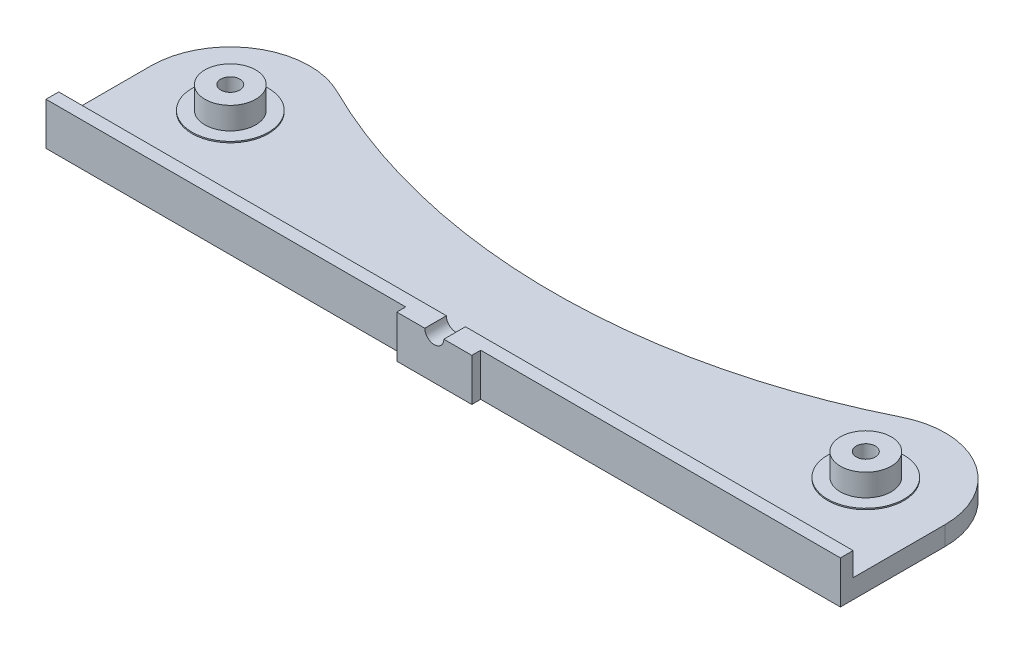
ISO-10303-21;
HEADER;
FILE_DESCRIPTION(('STEP AP214'),'2;1');
FILE_NAME('part.step','',(''),(''),'','','');
FILE_SCHEMA(('AUTOMOTIVE_DESIGN { 1 0 10303 214 1 1 1 1 }'));
ENDSEC;
DATA;
#1=APPLICATION_CONTEXT('core data for automotive mechanical design processes');
#2=APPLICATION_PROTOCOL_DEFINITION('international standard','automotive_design',2000,#1);
#3=PRODUCT_CONTEXT('',#1,'mechanical');
#4=PRODUCT('Part','Part','',(#3));
#5=PRODUCT_RELATED_PRODUCT_CATEGORY('part','',(#4));
#6=PRODUCT_DEFINITION_FORMATION('','',#4);
#7=PRODUCT_DEFINITION_CONTEXT('part definition',#1,'design');
#8=PRODUCT_DEFINITION('design','',#6,#7);
#9=PRODUCT_DEFINITION_SHAPE('','',#8);
#10=(LENGTH_UNIT() NAMED_UNIT(*) SI_UNIT(.MILLI.,.METRE.));
#11=(NAMED_UNIT(*) PLANE_ANGLE_UNIT() SI_UNIT($,.RADIAN.));
#12=(NAMED_UNIT(*) SI_UNIT($,.STERADIAN.) SOLID_ANGLE_UNIT());
#13=UNCERTAINTY_MEASURE_WITH_UNIT(LENGTH_MEASURE(1.E-05),#10,'distance_accuracy_value','');
#14=(GEOMETRIC_REPRESENTATION_CONTEXT(3) GLOBAL_UNCERTAINTY_ASSIGNED_CONTEXT((#13)) GLOBAL_UNIT_ASSIGNED_CONTEXT((#10,
#11,#12)) REPRESENTATION_CONTEXT('',''));
#15=CARTESIAN_POINT('',(0.,0.,0.));
#16=DIRECTION('',(0.,0.,1.));
#17=DIRECTION('',(1.,0.,0.));
#18=AXIS2_PLACEMENT_3D('',#15,#16,#17);
#19=CARTESIAN_POINT('',(0.,6.7,0.));
#20=DIRECTION('',(0.,1.,0.));
#21=DIRECTION('',(0.,0.,1.));
#22=AXIS2_PLACEMENT_3D('',#19,#20,#21);
#23=PLANE('',#22);
#24=DIRECTION('',(0.,0.,-1.));
#25=VECTOR('',#24,1.);
#26=CARTESIAN_POINT('',(1.5,6.7,1.4));
#27=LINE('',#26,#25);
#28=CARTESIAN_POINT('',(1.5,6.7,1.4));
#29=VERTEX_POINT('',#28);
#30=CARTESIAN_POINT('',(1.5,6.7,-2.));
#31=VERTEX_POINT('',#30);
#32=EDGE_CURVE('E95',#29,#31,#27,.T.);
#33=ORIENTED_EDGE('',*,*,#32,.F.);
#34=DIRECTION('',(-1.,0.,0.));
#35=VECTOR('',#34,1.);
#36=CARTESIAN_POINT('',(0.,6.7,1.4));
#37=LINE('',#36,#35);
#38=CARTESIAN_POINT('',(5.9,6.7,1.4));
#39=VERTEX_POINT('',#38);
#40=EDGE_CURVE('E193',#39,#29,#37,.T.);
#41=ORIENTED_EDGE('',*,*,#40,.F.);
#42=DIRECTION('',(0.,0.,-1.));
#43=VECTOR('',#42,1.);
#44=CARTESIAN_POINT('',(5.9,6.7,0.));
#45=LINE('',#44,#43);
#46=CARTESIAN_POINT('',(5.9,6.7,0.));
#47=VERTEX_POINT('',#46);
#48=EDGE_CURVE('E202',#39,#47,#45,.T.);
#49=ORIENTED_EDGE('',*,*,#48,.T.);
#50=DIRECTION('',(-1.,0.,0.));
#51=VECTOR('',#50,1.);
#52=CARTESIAN_POINT('',(0.,6.7,0.));
#53=LINE('',#52,#51);
#54=CARTESIAN_POINT('',(62.5,6.7,0.));
#55=VERTEX_POINT('',#54);
#56=EDGE_CURVE('E206',#55,#47,#53,.T.);
#57=ORIENTED_EDGE('',*,*,#56,.F.);
#58=DIRECTION('',(0.,0.,1.));
#59=VECTOR('',#58,1.);
#60=CARTESIAN_POINT('',(62.5,6.7,0.));
#61=LINE('',#60,#59);
#62=CARTESIAN_POINT('',(62.5,6.7,-2.));
#63=VERTEX_POINT('',#62);
#64=EDGE_CURVE('E305',#63,#55,#61,.T.);
#65=ORIENTED_EDGE('',*,*,#64,.F.);
#66=DIRECTION('',(-1.,0.,0.));
#67=VECTOR('',#66,1.);
#68=CARTESIAN_POINT('',(0.,6.7,-2.));
#69=LINE('',#68,#67);
#70=EDGE_CURVE('E312',#63,#31,#69,.T.);
#71=ORIENTED_EDGE('',*,*,#70,.T.);
#72=EDGE_LOOP('',(#33,#41,#49,#57,#65,#71));
#73=FACE_BOUND('',#72,.T.);
#74=ADVANCED_FACE('F78',(#73),#23,.T.);
#75=CARTESIAN_POINT('',(0.,3.,0.));
#76=DIRECTION('',(0.,1.,0.));
#77=DIRECTION('',(0.,0.,1.));
#78=AXIS2_PLACEMENT_3D('',#75,#76,#77);
#79=PLANE('',#78);
#80=CARTESIAN_POINT('',(50.,3.,-16.5));
#81=DIRECTION('',(0.,1.,0.));
#82=DIRECTION('',(0.,0.,1.));
#83=AXIS2_PLACEMENT_3D('',#80,#81,#82);
#84=CIRCLE('',#83,6.);
#85=CARTESIAN_POINT('',(50.,3.,-10.5));
#86=VERTEX_POINT('',#85);
#87=EDGE_CURVE('E301',#86,#86,#84,.T.);
#88=ORIENTED_EDGE('',*,*,#87,.F.);
#89=EDGE_LOOP('',(#88));
#90=FACE_BOUND('',#89,.T.);
#91=CARTESIAN_POINT('',(-50.,3.,-16.5));
#92=DIRECTION('',(0.,1.,0.));
#93=DIRECTION('',(0.,0.,1.));
#94=AXIS2_PLACEMENT_3D('',#91,#92,#93);
#95=CIRCLE('',#94,6.);
#96=CARTESIAN_POINT('',(-50.,3.,-10.5));
#97=VERTEX_POINT('',#96);
#98=EDGE_CURVE('E294',#97,#97,#95,.T.);
#99=ORIENTED_EDGE('',*,*,#98,.F.);
#100=EDGE_LOOP('',(#99));
#101=FACE_BOUND('',#100,.T.);
#102=DIRECTION('',(0.,0.,-1.));
#103=VECTOR('',#102,1.);
#104=CARTESIAN_POINT('',(-62.5,3.,0.));
#105=LINE('',#104,#103);
#106=CARTESIAN_POINT('',(-62.5,3.,-2.));
#107=VERTEX_POINT('',#106);
#108=CARTESIAN_POINT('',(-62.5,3.,-16.5));
#109=VERTEX_POINT('',#108);
#110=EDGE_CURVE('E237',#107,#109,#105,.T.);
#111=ORIENTED_EDGE('',*,*,#110,.F.);
#112=DIRECTION('',(-1.,0.,0.));
#113=VECTOR('',#112,1.);
#114=CARTESIAN_POINT('',(0.,3.,-2.));
#115=LINE('',#114,#113);
#116=CARTESIAN_POINT('',(62.5,3.,-2.));
#117=VERTEX_POINT('',#116);
#118=EDGE_CURVE('E216',#117,#107,#115,.T.);
#119=ORIENTED_EDGE('',*,*,#118,.F.);
#120=DIRECTION('',(0.,0.,-1.));
#121=VECTOR('',#120,1.);
#122=CARTESIAN_POINT('',(62.5,3.,0.));
#123=LINE('',#122,#121);
#124=CARTESIAN_POINT('',(62.5,3.,-16.5));
#125=VERTEX_POINT('',#124);
#126=EDGE_CURVE('E226',#117,#125,#123,.T.);
#127=ORIENTED_EDGE('',*,*,#126,.T.);
#128=CARTESIAN_POINT('',(50.,3.,-16.5));
#129=DIRECTION('',(0.,1.,0.));
#130=DIRECTION('',(0.,0.,1.));
#131=AXIS2_PLACEMENT_3D('',#128,#129,#130);
#132=CIRCLE('',#131,12.5);
#133=CARTESIAN_POINT('',(44.4444444444444,3.,-27.6975802059702));
#134=VERTEX_POINT('',#133);
#135=EDGE_CURVE('E228',#125,#134,#132,.T.);
#136=ORIENTED_EDGE('',*,*,#135,.T.);
#137=CARTESIAN_POINT('',(0.,3.,-117.278221853732));
#138=DIRECTION('',(0.,1.,0.));
#139=DIRECTION('',(0.,0.,1.));
#140=AXIS2_PLACEMENT_3D('',#137,#138,#139);
#141=CIRCLE('',#140,100.);
#142=CARTESIAN_POINT('',(-44.4444444444444,3.,-27.6975802059702));
#143=VERTEX_POINT('',#142);
#144=EDGE_CURVE('E231',#143,#134,#141,.T.);
#145=ORIENTED_EDGE('',*,*,#144,.F.);
#146=CARTESIAN_POINT('',(-50.,3.,-16.5));
#147=DIRECTION('',(0.,1.,0.));
#148=DIRECTION('',(0.,0.,1.));
#149=AXIS2_PLACEMENT_3D('',#146,#147,#148);
#150=CIRCLE('',#149,12.5);
#151=EDGE_CURVE('E234',#143,#109,#150,.T.);
#152=ORIENTED_EDGE('',*,*,#151,.T.);
#153=EDGE_LOOP('',(#111,#119,#127,#136,#145,#152));
#154=FACE_BOUND('',#153,.T.);
#155=ADVANCED_FACE('F369',(#90,#101,#154),#79,.T.);
#156=CARTESIAN_POINT('',(0.,0.,0.));
#157=DIRECTION('',(0.,1.,0.));
#158=DIRECTION('',(0.,0.,1.));
#159=AXIS2_PLACEMENT_3D('',#156,#157,#158);
#160=PLANE('',#159);
#161=DIRECTION('',(0.,0.,-1.));
#162=VECTOR('',#161,1.);
#163=CARTESIAN_POINT('',(-62.5,0.,0.));
#164=LINE('',#163,#162);
#165=CARTESIAN_POINT('',(-62.5,0.,0.));
#166=VERTEX_POINT('',#165);
#167=CARTESIAN_POINT('',(-62.5,0.,-16.5));
#168=VERTEX_POINT('',#167);
#169=EDGE_CURVE('E252',#166,#168,#164,.T.);
#170=ORIENTED_EDGE('',*,*,#169,.T.);
#171=CARTESIAN_POINT('',(-50.,0.,-16.5));
#172=DIRECTION('',(0.,1.,0.));
#173=DIRECTION('',(0.,0.,1.));
#174=AXIS2_PLACEMENT_3D('',#171,#172,#173);
#175=CIRCLE('',#174,12.5);
#176=CARTESIAN_POINT('',(-44.4444444444444,0.,-27.6975802059702));
#177=VERTEX_POINT('',#176);
#178=EDGE_CURVE('E249',#177,#168,#175,.T.);
#179=ORIENTED_EDGE('',*,*,#178,.F.);
#180=CARTESIAN_POINT('',(0.,0.,-117.278221853732));
#181=DIRECTION('',(0.,1.,0.));
#182=DIRECTION('',(0.,0.,1.));
#183=AXIS2_PLACEMENT_3D('',#180,#181,#182);
#184=CIRCLE('',#183,100.);
#185=CARTESIAN_POINT('',(44.4444444444444,0.,-27.6975802059702));
#186=VERTEX_POINT('',#185);
#187=EDGE_CURVE('E246',#177,#186,#184,.T.);
#188=ORIENTED_EDGE('',*,*,#187,.T.);
#189=CARTESIAN_POINT('',(50.,0.,-16.5));
#190=DIRECTION('',(0.,1.,0.));
#191=DIRECTION('',(0.,0.,1.));
#192=AXIS2_PLACEMENT_3D('',#189,#190,#191);
#193=CIRCLE('',#192,12.5);
#194=CARTESIAN_POINT('',(62.5,0.,-16.5));
#195=VERTEX_POINT('',#194);
#196=EDGE_CURVE('E242',#195,#186,#193,.T.);
#197=ORIENTED_EDGE('',*,*,#196,.F.);
#198=DIRECTION('',(0.,0.,-1.));
#199=VECTOR('',#198,1.);
#200=CARTESIAN_POINT('',(62.5,0.,0.));
#201=LINE('',#200,#199);
#202=CARTESIAN_POINT('',(62.5,0.,0.));
#203=VERTEX_POINT('',#202);
#204=EDGE_CURVE('E240',#203,#195,#201,.T.);
#205=ORIENTED_EDGE('',*,*,#204,.F.);
#206=DIRECTION('',(1.,0.,0.));
#207=VECTOR('',#206,1.);
#208=CARTESIAN_POINT('',(0.,0.,0.));
#209=LINE('',#208,#207);
#210=CARTESIAN_POINT('',(5.9,0.,0.));
#211=VERTEX_POINT('',#210);
#212=EDGE_CURVE('E254',#211,#203,#209,.T.);
#213=ORIENTED_EDGE('',*,*,#212,.F.);
#214=DIRECTION('',(0.,0.,1.));
#215=VECTOR('',#214,1.);
#216=CARTESIAN_POINT('',(5.9,0.,0.));
#217=LINE('',#216,#215);
#218=CARTESIAN_POINT('',(5.9,0.,1.4));
#219=VERTEX_POINT('',#218);
#220=EDGE_CURVE('E280',#211,#219,#217,.T.);
#221=ORIENTED_EDGE('',*,*,#220,.T.);
#222=DIRECTION('',(1.,0.,0.));
#223=VECTOR('',#222,1.);
#224=CARTESIAN_POINT('',(-5.9,0.,1.4));
#225=LINE('',#224,#223);
#226=CARTESIAN_POINT('',(-5.9,0.,1.4));
#227=VERTEX_POINT('',#226);
#228=EDGE_CURVE('E225',#227,#219,#225,.T.);
#229=ORIENTED_EDGE('',*,*,#228,.F.);
#230=DIRECTION('',(0.,0.,1.));
#231=VECTOR('',#230,1.);
#232=CARTESIAN_POINT('',(-5.9,0.,0.));
#233=LINE('',#232,#231);
#234=CARTESIAN_POINT('',(-5.9,0.,0.));
#235=VERTEX_POINT('',#234);
#236=EDGE_CURVE('E283',#235,#227,#233,.T.);
#237=ORIENTED_EDGE('',*,*,#236,.F.);
#238=EDGE_CURVE('E255',#166,#235,#209,.T.);
#239=ORIENTED_EDGE('',*,*,#238,.F.);
#240=EDGE_LOOP('',(#170,#179,#188,#197,#205,#213,#221,#229,#237,#239));
#241=FACE_BOUND('',#240,.T.);
#242=CARTESIAN_POINT('',(-50.,0.,-16.5));
#243=DIRECTION('',(0.,1.,0.));
#244=DIRECTION('',(0.,0.,1.));
#245=AXIS2_PLACEMENT_3D('',#242,#243,#244);
#246=CIRCLE('',#245,1.5);
#247=CARTESIAN_POINT('',(-50.,0.,-15.));
#248=VERTEX_POINT('',#247);
#249=EDGE_CURVE('E229',#248,#248,#246,.T.);
#250=ORIENTED_EDGE('',*,*,#249,.T.);
#251=EDGE_LOOP('',(#250));
#252=FACE_BOUND('',#251,.T.);
#253=CARTESIAN_POINT('',(50.,0.,-16.5));
#254=DIRECTION('',(0.,1.,0.));
#255=DIRECTION('',(0.,0.,1.));
#256=AXIS2_PLACEMENT_3D('',#253,#254,#255);
#257=CIRCLE('',#256,1.5);
#258=CARTESIAN_POINT('',(50.,0.,-15.));
#259=VERTEX_POINT('',#258);
#260=EDGE_CURVE('E258',#259,#259,#257,.T.);
#261=ORIENTED_EDGE('',*,*,#260,.T.);
#262=EDGE_LOOP('',(#261));
#263=FACE_BOUND('',#262,.T.);
#264=ADVANCED_FACE('F328',(#241,#252,#263),#160,.F.);
#265=CARTESIAN_POINT('',(0.,3.,0.));
#266=DIRECTION('',(0.,0.,-1.));
#267=DIRECTION('',(-1.,0.,0.));
#268=AXIS2_PLACEMENT_3D('',#265,#266,#267);
#269=PLANE('',#268);
#270=DIRECTION('',(0.,-1.,0.));
#271=VECTOR('',#270,1.);
#272=CARTESIAN_POINT('',(-5.9,3.,0.));
#273=LINE('',#272,#271);
#274=CARTESIAN_POINT('',(-5.9,6.7,0.));
#275=VERTEX_POINT('',#274);
#276=EDGE_CURVE('E277',#275,#235,#273,.T.);
#277=ORIENTED_EDGE('',*,*,#276,.F.);
#278=CARTESIAN_POINT('',(-62.5,6.7,0.));
#279=VERTEX_POINT('',#278);
#280=EDGE_CURVE('E308',#275,#279,#53,.T.);
#281=ORIENTED_EDGE('',*,*,#280,.T.);
#282=DIRECTION('',(0.,-1.,0.));
#283=VECTOR('',#282,1.);
#284=CARTESIAN_POINT('',(-62.5,3.,0.));
#285=LINE('',#284,#283);
#286=EDGE_CURVE('E265',#279,#166,#285,.T.);
#287=ORIENTED_EDGE('',*,*,#286,.T.);
#288=ORIENTED_EDGE('',*,*,#238,.T.);
#289=EDGE_LOOP('',(#277,#281,#287,#288));
#290=FACE_BOUND('',#289,.T.);
#291=ADVANCED_FACE('F321',(#290),#269,.F.);
#292=DIRECTION('',(0.,-1.,0.));
#293=VECTOR('',#292,1.);
#294=CARTESIAN_POINT('',(62.5,3.,0.));
#295=LINE('',#294,#293);
#296=EDGE_CURVE('E239',#55,#203,#295,.T.);
#297=ORIENTED_EDGE('',*,*,#296,.F.);
#298=ORIENTED_EDGE('',*,*,#56,.T.);
#299=DIRECTION('',(0.,-1.,0.));
#300=VECTOR('',#299,1.);
#301=CARTESIAN_POINT('',(5.9,3.,0.));
#302=LINE('',#301,#300);
#303=EDGE_CURVE('E87',#47,#211,#302,.T.);
#304=ORIENTED_EDGE('',*,*,#303,.T.);
#305=ORIENTED_EDGE('',*,*,#212,.T.);
#306=EDGE_LOOP('',(#297,#298,#304,#305));
#307=FACE_BOUND('',#306,.T.);
#308=ADVANCED_FACE('F362',(#307),#269,.F.);
#309=CARTESIAN_POINT('',(5.9,3.,0.));
#310=DIRECTION('',(1.,0.,0.));
#311=DIRECTION('',(0.,0.,-1.));
#312=AXIS2_PLACEMENT_3D('',#309,#310,#311);
#313=PLANE('',#312);
#314=ORIENTED_EDGE('',*,*,#220,.F.);
#315=ORIENTED_EDGE('',*,*,#303,.F.);
#316=ORIENTED_EDGE('',*,*,#48,.F.);
#317=DIRECTION('',(0.,-1.,0.));
#318=VECTOR('',#317,1.);
#319=CARTESIAN_POINT('',(5.9,3.,1.4));
#320=LINE('',#319,#318);
#321=EDGE_CURVE('E243',#39,#219,#320,.T.);
#322=ORIENTED_EDGE('',*,*,#321,.T.);
#323=EDGE_LOOP('',(#314,#315,#316,#322));
#324=FACE_BOUND('',#323,.T.);
#325=ADVANCED_FACE('F334',(#324),#313,.T.);
#326=CARTESIAN_POINT('',(-5.9,3.,0.));
#327=DIRECTION('',(1.,0.,0.));
#328=DIRECTION('',(0.,0.,-1.));
#329=AXIS2_PLACEMENT_3D('',#326,#327,#328);
#330=PLANE('',#329);
#331=ORIENTED_EDGE('',*,*,#236,.T.);
#332=DIRECTION('',(0.,-1.,0.));
#333=VECTOR('',#332,1.);
#334=CARTESIAN_POINT('',(-5.9,3.,1.4));
#335=LINE('',#334,#333);
#336=CARTESIAN_POINT('',(-5.9,6.7,1.4));
#337=VERTEX_POINT('',#336);
#338=EDGE_CURVE('E285',#337,#227,#335,.T.);
#339=ORIENTED_EDGE('',*,*,#338,.F.);
#340=DIRECTION('',(0.,0.,-1.));
#341=VECTOR('',#340,1.);
#342=CARTESIAN_POINT('',(-5.9,6.7,0.));
#343=LINE('',#342,#341);
#344=EDGE_CURVE('E200',#337,#275,#343,.T.);
#345=ORIENTED_EDGE('',*,*,#344,.T.);
#346=ORIENTED_EDGE('',*,*,#276,.T.);
#347=EDGE_LOOP('',(#331,#339,#345,#346));
#348=FACE_BOUND('',#347,.T.);
#349=ADVANCED_FACE('F324',(#348),#330,.F.);
#350=CARTESIAN_POINT('',(-5.9,3.,1.4));
#351=DIRECTION('',(0.,0.,-1.));
#352=DIRECTION('',(-1.,0.,0.));
#353=AXIS2_PLACEMENT_3D('',#350,#351,#352);
#354=PLANE('',#353);
#355=ORIENTED_EDGE('',*,*,#40,.T.);
#356=CARTESIAN_POINT('',(0.,6.7,1.4));
#357=DIRECTION('',(0.,0.,-1.));
#358=DIRECTION('',(-1.,0.,0.));
#359=AXIS2_PLACEMENT_3D('',#356,#357,#358);
#360=CIRCLE('',#359,1.5);
#361=CARTESIAN_POINT('',(-1.5,6.7,1.4));
#362=VERTEX_POINT('',#361);
#363=EDGE_CURVE('E182',#29,#362,#360,.T.);
#364=ORIENTED_EDGE('',*,*,#363,.T.);
#365=EDGE_CURVE('E190',#362,#337,#37,.T.);
#366=ORIENTED_EDGE('',*,*,#365,.T.);
#367=ORIENTED_EDGE('',*,*,#338,.T.);
#368=ORIENTED_EDGE('',*,*,#228,.T.);
#369=ORIENTED_EDGE('',*,*,#321,.F.);
#370=EDGE_LOOP('',(#355,#364,#366,#367,#368,#369));
#371=FACE_BOUND('',#370,.T.);
#372=ADVANCED_FACE('F80',(#371),#354,.F.);
#373=CARTESIAN_POINT('',(62.5,3.,0.));
#374=DIRECTION('',(-1.,0.,0.));
#375=DIRECTION('',(0.,0.,1.));
#376=AXIS2_PLACEMENT_3D('',#373,#374,#375);
#377=PLANE('',#376);
#378=DIRECTION('',(0.,-1.,0.));
#379=VECTOR('',#378,1.);
#380=CARTESIAN_POINT('',(62.5,3.,-16.5));
#381=LINE('',#380,#379);
#382=EDGE_CURVE('E274',#125,#195,#381,.T.);
#383=ORIENTED_EDGE('',*,*,#382,.F.);
#384=ORIENTED_EDGE('',*,*,#126,.F.);
#385=DIRECTION('',(0.,-1.,0.));
#386=VECTOR('',#385,1.);
#387=CARTESIAN_POINT('',(62.5,6.7,-2.));
#388=LINE('',#387,#386);
#389=EDGE_CURVE('E211',#63,#117,#388,.T.);
#390=ORIENTED_EDGE('',*,*,#389,.F.);
#391=ORIENTED_EDGE('',*,*,#64,.T.);
#392=ORIENTED_EDGE('',*,*,#296,.T.);
#393=ORIENTED_EDGE('',*,*,#204,.T.);
#394=EDGE_LOOP('',(#383,#384,#390,#391,#392,#393));
#395=FACE_BOUND('',#394,.T.);
#396=ADVANCED_FACE('F360',(#395),#377,.F.);
#397=CARTESIAN_POINT('',(50.,3.,-16.5));
#398=DIRECTION('',(0.,-1.,0.));
#399=DIRECTION('',(0.,0.,-1.));
#400=AXIS2_PLACEMENT_3D('',#397,#398,#399);
#401=CYLINDRICAL_SURFACE('',#400,12.5);
#402=ORIENTED_EDGE('',*,*,#196,.T.);
#403=DIRECTION('',(0.,-1.,0.));
#404=VECTOR('',#403,1.);
#405=CARTESIAN_POINT('',(44.4444444444444,3.,-27.6975802059702));
#406=LINE('',#405,#404);
#407=EDGE_CURVE('E272',#134,#186,#406,.T.);
#408=ORIENTED_EDGE('',*,*,#407,.F.);
#409=ORIENTED_EDGE('',*,*,#135,.F.);
#410=ORIENTED_EDGE('',*,*,#382,.T.);
#411=EDGE_LOOP('',(#402,#408,#409,#410));
#412=FACE_BOUND('',#411,.T.);
#413=ADVANCED_FACE('F357',(#412),#401,.T.);
#414=CARTESIAN_POINT('',(0.,3.,-117.278221853732));
#415=DIRECTION('',(0.,-1.,0.));
#416=DIRECTION('',(0.,0.,-1.));
#417=AXIS2_PLACEMENT_3D('',#414,#415,#416);
#418=CYLINDRICAL_SURFACE('',#417,100.);
#419=ORIENTED_EDGE('',*,*,#187,.F.);
#420=DIRECTION('',(0.,-1.,0.));
#421=VECTOR('',#420,1.);
#422=CARTESIAN_POINT('',(-44.4444444444444,3.,-27.6975802059702));
#423=LINE('',#422,#421);
#424=EDGE_CURVE('E270',#143,#177,#423,.T.);
#425=ORIENTED_EDGE('',*,*,#424,.F.);
#426=ORIENTED_EDGE('',*,*,#144,.T.);
#427=ORIENTED_EDGE('',*,*,#407,.T.);
#428=EDGE_LOOP('',(#419,#425,#426,#427));
#429=FACE_BOUND('',#428,.T.);
#430=ADVANCED_FACE('F351',(#429),#418,.F.);
#431=CARTESIAN_POINT('',(-50.,3.,-16.5));
#432=DIRECTION('',(0.,-1.,0.));
#433=DIRECTION('',(0.,0.,-1.));
#434=AXIS2_PLACEMENT_3D('',#431,#432,#433);
#435=CYLINDRICAL_SURFACE('',#434,12.5);
#436=ORIENTED_EDGE('',*,*,#178,.T.);
#437=DIRECTION('',(0.,-1.,0.));
#438=VECTOR('',#437,1.);
#439=CARTESIAN_POINT('',(-62.5,3.,-16.5));
#440=LINE('',#439,#438);
#441=EDGE_CURVE('E267',#109,#168,#440,.T.);
#442=ORIENTED_EDGE('',*,*,#441,.F.);
#443=ORIENTED_EDGE('',*,*,#151,.F.);
#444=ORIENTED_EDGE('',*,*,#424,.T.);
#445=EDGE_LOOP('',(#436,#442,#443,#444));
#446=FACE_BOUND('',#445,.T.);
#447=ADVANCED_FACE('F425',(#446),#435,.T.);
#448=CARTESIAN_POINT('',(-62.5,3.,0.));
#449=DIRECTION('',(-1.,0.,0.));
#450=DIRECTION('',(0.,0.,1.));
#451=AXIS2_PLACEMENT_3D('',#448,#449,#450);
#452=PLANE('',#451);
#453=ORIENTED_EDGE('',*,*,#441,.T.);
#454=ORIENTED_EDGE('',*,*,#169,.F.);
#455=ORIENTED_EDGE('',*,*,#286,.F.);
#456=DIRECTION('',(0.,0.,1.));
#457=VECTOR('',#456,1.);
#458=CARTESIAN_POINT('',(-62.5,6.7,0.));
#459=LINE('',#458,#457);
#460=CARTESIAN_POINT('',(-62.5,6.7,-2.));
#461=VERTEX_POINT('',#460);
#462=EDGE_CURVE('E314',#461,#279,#459,.T.);
#463=ORIENTED_EDGE('',*,*,#462,.F.);
#464=DIRECTION('',(0.,-1.,0.));
#465=VECTOR('',#464,1.);
#466=CARTESIAN_POINT('',(-62.5,6.7,-2.));
#467=LINE('',#466,#465);
#468=EDGE_CURVE('E102',#461,#107,#467,.T.);
#469=ORIENTED_EDGE('',*,*,#468,.T.);
#470=ORIENTED_EDGE('',*,*,#110,.T.);
#471=EDGE_LOOP('',(#453,#454,#455,#463,#469,#470));
#472=FACE_BOUND('',#471,.T.);
#473=ADVANCED_FACE('F343',(#472),#452,.T.);
#474=CARTESIAN_POINT('',(50.,3.,-16.5));
#475=DIRECTION('',(0.,-1.,0.));
#476=DIRECTION('',(0.,0.,-1.));
#477=AXIS2_PLACEMENT_3D('',#474,#475,#476);
#478=CYLINDRICAL_SURFACE('',#477,1.5);
#479=CARTESIAN_POINT('',(50.,6.7,-16.5));
#480=DIRECTION('',(0.,1.,0.));
#481=DIRECTION('',(0.,0.,1.));
#482=AXIS2_PLACEMENT_3D('',#479,#480,#481);
#483=CIRCLE('',#482,1.5);
#484=CARTESIAN_POINT('',(50.,6.7,-15.));
#485=VERTEX_POINT('',#484);
#486=EDGE_CURVE('E215',#485,#485,#483,.T.);
#487=ORIENTED_EDGE('',*,*,#486,.T.);
#488=EDGE_LOOP('',(#487));
#489=FACE_BOUND('',#488,.T.);
#490=ORIENTED_EDGE('',*,*,#260,.F.);
#491=EDGE_LOOP('',(#490));
#492=FACE_BOUND('',#491,.T.);
#493=ADVANCED_FACE('F432',(#489,#492),#478,.F.);
#494=CARTESIAN_POINT('',(-50.,3.,-16.5));
#495=DIRECTION('',(0.,-1.,0.));
#496=DIRECTION('',(0.,0.,-1.));
#497=AXIS2_PLACEMENT_3D('',#494,#495,#496);
#498=CYLINDRICAL_SURFACE('',#497,1.5);
#499=CARTESIAN_POINT('',(-50.,6.7,-16.5));
#500=DIRECTION('',(0.,1.,0.));
#501=DIRECTION('',(0.,0.,1.));
#502=AXIS2_PLACEMENT_3D('',#499,#500,#501);
#503=CIRCLE('',#502,1.5);
#504=CARTESIAN_POINT('',(-50.,6.7,-15.));
#505=VERTEX_POINT('',#504);
#506=EDGE_CURVE('E219',#505,#505,#503,.T.);
#507=ORIENTED_EDGE('',*,*,#506,.T.);
#508=EDGE_LOOP('',(#507));
#509=FACE_BOUND('',#508,.T.);
#510=ORIENTED_EDGE('',*,*,#249,.F.);
#511=EDGE_LOOP('',(#510));
#512=FACE_BOUND('',#511,.T.);
#513=ADVANCED_FACE('F523',(#509,#512),#498,.F.);
#514=CARTESIAN_POINT('',(-50.,6.7,-16.5));
#515=DIRECTION('',(0.,1.,0.));
#516=DIRECTION('',(0.,0.,1.));
#517=AXIS2_PLACEMENT_3D('',#514,#515,#516);
#518=PLANE('',#517);
#519=CARTESIAN_POINT('',(-50.,6.7,-16.5));
#520=DIRECTION('',(0.,1.,0.));
#521=DIRECTION('',(0.,0.,1.));
#522=AXIS2_PLACEMENT_3D('',#519,#520,#521);
#523=CIRCLE('',#522,4.00000000000001);
#524=CARTESIAN_POINT('',(-50.,6.7,-12.5));
#525=VERTEX_POINT('',#524);
#526=EDGE_CURVE('E222',#525,#525,#523,.T.);
#527=ORIENTED_EDGE('',*,*,#526,.T.);
#528=EDGE_LOOP('',(#527));
#529=FACE_BOUND('',#528,.T.);
#530=ORIENTED_EDGE('',*,*,#506,.F.);
#531=EDGE_LOOP('',(#530));
#532=FACE_BOUND('',#531,.T.);
#533=ADVANCED_FACE('F535',(#529,#532),#518,.T.);
#534=CARTESIAN_POINT('',(-50.,6.7,-16.5));
#535=DIRECTION('',(0.,-1.,0.));
#536=DIRECTION('',(0.,0.,-1.));
#537=AXIS2_PLACEMENT_3D('',#534,#535,#536);
#538=CYLINDRICAL_SURFACE('',#537,4.00000000000001);
#539=CARTESIAN_POINT('',(-50.,3.2,-16.5));
#540=DIRECTION('',(0.,1.,0.));
#541=DIRECTION('',(0.,0.,1.));
#542=AXIS2_PLACEMENT_3D('',#539,#540,#541);
#543=CIRCLE('',#542,4.00000000000001);
#544=CARTESIAN_POINT('',(-50.,3.2,-12.5));
#545=VERTEX_POINT('',#544);
#546=EDGE_CURVE('E194',#545,#545,#543,.T.);
#547=ORIENTED_EDGE('',*,*,#546,.T.);
#548=EDGE_LOOP('',(#547));
#549=FACE_BOUND('',#548,.T.);
#550=ORIENTED_EDGE('',*,*,#526,.F.);
#551=EDGE_LOOP('',(#550));
#552=FACE_BOUND('',#551,.T.);
#553=ADVANCED_FACE('F547',(#549,#552),#538,.T.);
#554=CARTESIAN_POINT('',(50.,6.7,-16.5));
#555=DIRECTION('',(0.,1.,0.));
#556=DIRECTION('',(0.,0.,1.));
#557=AXIS2_PLACEMENT_3D('',#554,#555,#556);
#558=PLANE('',#557);
#559=CARTESIAN_POINT('',(50.,6.7,-16.5));
#560=DIRECTION('',(0.,1.,0.));
#561=DIRECTION('',(0.,0.,1.));
#562=AXIS2_PLACEMENT_3D('',#559,#560,#561);
#563=CIRCLE('',#562,4.00000000000001);
#564=CARTESIAN_POINT('',(50.,6.7,-12.5));
#565=VERTEX_POINT('',#564);
#566=EDGE_CURVE('E212',#565,#565,#563,.T.);
#567=ORIENTED_EDGE('',*,*,#566,.T.);
#568=EDGE_LOOP('',(#567));
#569=FACE_BOUND('',#568,.T.);
#570=ORIENTED_EDGE('',*,*,#486,.F.);
#571=EDGE_LOOP('',(#570));
#572=FACE_BOUND('',#571,.T.);
#573=ADVANCED_FACE('F389',(#569,#572),#558,.T.);
#574=CARTESIAN_POINT('',(50.,6.7,-16.5));
#575=DIRECTION('',(0.,-1.,0.));
#576=DIRECTION('',(0.,0.,-1.));
#577=AXIS2_PLACEMENT_3D('',#574,#575,#576);
#578=CYLINDRICAL_SURFACE('',#577,4.00000000000001);
#579=CARTESIAN_POINT('',(50.,3.2,-16.5));
#580=DIRECTION('',(0.,1.,0.));
#581=DIRECTION('',(0.,0.,1.));
#582=AXIS2_PLACEMENT_3D('',#579,#580,#581);
#583=CIRCLE('',#582,4.00000000000001);
#584=CARTESIAN_POINT('',(50.,3.2,-12.5));
#585=VERTEX_POINT('',#584);
#586=EDGE_CURVE('E82',#585,#585,#583,.T.);
#587=ORIENTED_EDGE('',*,*,#586,.T.);
#588=EDGE_LOOP('',(#587));
#589=FACE_BOUND('',#588,.T.);
#590=ORIENTED_EDGE('',*,*,#566,.F.);
#591=EDGE_LOOP('',(#590));
#592=FACE_BOUND('',#591,.T.);
#593=ADVANCED_FACE('F384',(#589,#592),#578,.T.);
#594=DIRECTION('',(0.,0.,-1.));
#595=VECTOR('',#594,1.);
#596=CARTESIAN_POINT('',(-1.5,6.7,1.4));
#597=LINE('',#596,#595);
#598=CARTESIAN_POINT('',(-1.5,6.7,-2.));
#599=VERTEX_POINT('',#598);
#600=EDGE_CURVE('E179',#599,#362,#597,.F.);
#601=ORIENTED_EDGE('',*,*,#600,.F.);
#602=EDGE_CURVE('E311',#599,#461,#69,.T.);
#603=ORIENTED_EDGE('',*,*,#602,.T.);
#604=ORIENTED_EDGE('',*,*,#462,.T.);
#605=ORIENTED_EDGE('',*,*,#280,.F.);
#606=ORIENTED_EDGE('',*,*,#344,.F.);
#607=ORIENTED_EDGE('',*,*,#365,.F.);
#608=EDGE_LOOP('',(#601,#603,#604,#605,#606,#607));
#609=FACE_BOUND('',#608,.T.);
#610=ADVANCED_FACE('F197',(#609),#23,.T.);
#611=CARTESIAN_POINT('',(0.,6.7,-2.));
#612=DIRECTION('',(0.,0.,1.));
#613=DIRECTION('',(1.,0.,0.));
#614=AXIS2_PLACEMENT_3D('',#611,#612,#613);
#615=PLANE('',#614);
#616=ORIENTED_EDGE('',*,*,#602,.F.);
#617=CARTESIAN_POINT('',(0.,6.7,-2.));
#618=DIRECTION('',(0.,0.,1.));
#619=DIRECTION('',(1.,0.,0.));
#620=AXIS2_PLACEMENT_3D('',#617,#618,#619);
#621=CIRCLE('',#620,1.5);
#622=EDGE_CURVE('E12',#599,#31,#621,.T.);
#623=ORIENTED_EDGE('',*,*,#622,.T.);
#624=ORIENTED_EDGE('',*,*,#70,.F.);
#625=ORIENTED_EDGE('',*,*,#389,.T.);
#626=ORIENTED_EDGE('',*,*,#118,.T.);
#627=ORIENTED_EDGE('',*,*,#468,.F.);
#628=EDGE_LOOP('',(#616,#623,#624,#625,#626,#627));
#629=FACE_BOUND('',#628,.T.);
#630=ADVANCED_FACE('F340',(#629),#615,.F.);
#631=CARTESIAN_POINT('',(0.,6.7,1.4));
#632=DIRECTION('',(0.,0.,-1.));
#633=DIRECTION('',(-1.,0.,0.));
#634=AXIS2_PLACEMENT_3D('',#631,#632,#633);
#635=CYLINDRICAL_SURFACE('',#634,1.5);
#636=ORIENTED_EDGE('',*,*,#32,.T.);
#637=ORIENTED_EDGE('',*,*,#622,.F.);
#638=ORIENTED_EDGE('',*,*,#600,.T.);
#639=ORIENTED_EDGE('',*,*,#363,.F.);
#640=EDGE_LOOP('',(#636,#637,#638,#639));
#641=FACE_BOUND('',#640,.T.);
#642=ADVANCED_FACE('F181',(#641),#635,.F.);
#643=CARTESIAN_POINT('',(-50.,3.2,-16.5));
#644=DIRECTION('',(0.,1.,0.));
#645=DIRECTION('',(0.,0.,1.));
#646=AXIS2_PLACEMENT_3D('',#643,#644,#645);
#647=PLANE('',#646);
#648=ORIENTED_EDGE('',*,*,#546,.F.);
#649=EDGE_LOOP('',(#648));
#650=FACE_BOUND('',#649,.T.);
#651=CARTESIAN_POINT('',(-50.,3.2,-16.5));
#652=DIRECTION('',(0.,1.,0.));
#653=DIRECTION('',(0.,0.,1.));
#654=AXIS2_PLACEMENT_3D('',#651,#652,#653);
#655=CIRCLE('',#654,6.);
#656=CARTESIAN_POINT('',(-50.,3.2,-10.5));
#657=VERTEX_POINT('',#656);
#658=EDGE_CURVE('E290',#657,#657,#655,.T.);
#659=ORIENTED_EDGE('',*,*,#658,.T.);
#660=EDGE_LOOP('',(#659));
#661=FACE_BOUND('',#660,.T.);
#662=ADVANCED_FACE('F392',(#650,#661),#647,.T.);
#663=CARTESIAN_POINT('',(-50.,3.2,-16.5));
#664=DIRECTION('',(0.,-1.,0.));
#665=DIRECTION('',(0.,0.,-1.));
#666=AXIS2_PLACEMENT_3D('',#663,#664,#665);
#667=CYLINDRICAL_SURFACE('',#666,6.);
#668=ORIENTED_EDGE('',*,*,#658,.F.);
#669=EDGE_LOOP('',(#668));
#670=FACE_BOUND('',#669,.T.);
#671=ORIENTED_EDGE('',*,*,#98,.T.);
#672=EDGE_LOOP('',(#671));
#673=FACE_BOUND('',#672,.T.);
#674=ADVANCED_FACE('F397',(#670,#673),#667,.T.);
#675=CARTESIAN_POINT('',(50.,3.2,-16.5));
#676=DIRECTION('',(0.,1.,0.));
#677=DIRECTION('',(0.,0.,1.));
#678=AXIS2_PLACEMENT_3D('',#675,#676,#677);
#679=PLANE('',#678);
#680=ORIENTED_EDGE('',*,*,#586,.F.);
#681=EDGE_LOOP('',(#680));
#682=FACE_BOUND('',#681,.T.);
#683=CARTESIAN_POINT('',(50.,3.2,-16.5));
#684=DIRECTION('',(0.,1.,0.));
#685=DIRECTION('',(0.,0.,1.));
#686=AXIS2_PLACEMENT_3D('',#683,#684,#685);
#687=CIRCLE('',#686,6.);
#688=CARTESIAN_POINT('',(50.,3.2,-10.5));
#689=VERTEX_POINT('',#688);
#690=EDGE_CURVE('E418',#689,#689,#687,.T.);
#691=ORIENTED_EDGE('',*,*,#690,.T.);
#692=EDGE_LOOP('',(#691));
#693=FACE_BOUND('',#692,.T.);
#694=ADVANCED_FACE('F402',(#682,#693),#679,.T.);
#695=CARTESIAN_POINT('',(50.,3.2,-16.5));
#696=DIRECTION('',(0.,-1.,0.));
#697=DIRECTION('',(0.,0.,-1.));
#698=AXIS2_PLACEMENT_3D('',#695,#696,#697);
#699=CYLINDRICAL_SURFACE('',#698,6.);
#700=ORIENTED_EDGE('',*,*,#690,.F.);
#701=EDGE_LOOP('',(#700));
#702=FACE_BOUND('',#701,.T.);
#703=ORIENTED_EDGE('',*,*,#87,.T.);
#704=EDGE_LOOP('',(#703));
#705=FACE_BOUND('',#704,.T.);
#706=ADVANCED_FACE('F405',(#702,#705),#699,.T.);
#707=CLOSED_SHELL('',(#74,#155,#264,#291,#308,#325,#349,#372,#396,#413,#430,#447,#473,#493,#513,
#533,#553,#573,#593,#610,#630,#642,#662,#674,#694,#706));
#708=MANIFOLD_SOLID_BREP('B2',#707);
#709=ADVANCED_BREP_SHAPE_REPRESENTATION('',(#18,#708),#14);
#710=SHAPE_DEFINITION_REPRESENTATION(#9,#709);
ENDSEC;
END-ISO-10303-21;
